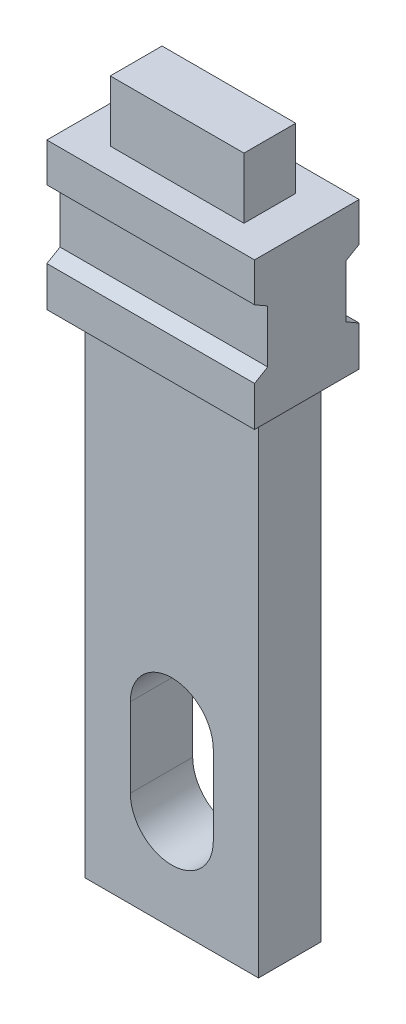
ISO-10303-21;
HEADER;
FILE_DESCRIPTION(('STEP AP214'),'2;1');
FILE_NAME('part.step','',(''),(''),'','','');
FILE_SCHEMA(('AUTOMOTIVE_DESIGN { 1 0 10303 214 1 1 1 1 }'));
ENDSEC;
DATA;
#1=APPLICATION_CONTEXT('core data for automotive mechanical design processes');
#2=APPLICATION_PROTOCOL_DEFINITION('international standard','automotive_design',2000,#1);
#3=PRODUCT_CONTEXT('',#1,'mechanical');
#4=PRODUCT('Part','Part','',(#3));
#5=PRODUCT_RELATED_PRODUCT_CATEGORY('part','',(#4));
#6=PRODUCT_DEFINITION_FORMATION('','',#4);
#7=PRODUCT_DEFINITION_CONTEXT('part definition',#1,'design');
#8=PRODUCT_DEFINITION('design','',#6,#7);
#9=PRODUCT_DEFINITION_SHAPE('','',#8);
#10=(LENGTH_UNIT() NAMED_UNIT(*) SI_UNIT(.MILLI.,.METRE.));
#11=(NAMED_UNIT(*) PLANE_ANGLE_UNIT() SI_UNIT($,.RADIAN.));
#12=(NAMED_UNIT(*) SI_UNIT($,.STERADIAN.) SOLID_ANGLE_UNIT());
#13=UNCERTAINTY_MEASURE_WITH_UNIT(LENGTH_MEASURE(1.E-05),#10,'distance_accuracy_value','');
#14=(GEOMETRIC_REPRESENTATION_CONTEXT(3) GLOBAL_UNCERTAINTY_ASSIGNED_CONTEXT((#13)) GLOBAL_UNIT_ASSIGNED_CONTEXT((#10,
#11,#12)) REPRESENTATION_CONTEXT('',''));
#15=CARTESIAN_POINT('',(0.,0.,0.));
#16=DIRECTION('',(0.,0.,1.));
#17=DIRECTION('',(1.,0.,0.));
#18=AXIS2_PLACEMENT_3D('',#15,#16,#17);
#19=CARTESIAN_POINT('',(-0.99822,0.5842,0.));
#20=DIRECTION('',(0.,1.,0.));
#21=DIRECTION('',(0.,0.,1.));
#22=AXIS2_PLACEMENT_3D('',#19,#20,#21);
#23=PLANE('',#22);
#24=DIRECTION('',(-1.,0.,0.));
#25=VECTOR('',#24,1.);
#26=CARTESIAN_POINT('',(0.64262,0.5842,-0.24892));
#27=LINE('',#26,#25);
#28=CARTESIAN_POINT('',(-0.64262,0.5842,-0.24892));
#29=VERTEX_POINT('',#28);
#30=CARTESIAN_POINT('',(0.64262,0.5842,-0.24892));
#31=VERTEX_POINT('',#30);
#32=EDGE_CURVE('E183',#29,#31,#27,.F.);
#33=ORIENTED_EDGE('',*,*,#32,.F.);
#34=DIRECTION('',(0.,0.,1.));
#35=VECTOR('',#34,1.);
#36=CARTESIAN_POINT('',(-0.64262,0.5842,-0.24892));
#37=LINE('',#36,#35);
#38=CARTESIAN_POINT('',(-0.64262,0.5842,0.24892));
#39=VERTEX_POINT('',#38);
#40=EDGE_CURVE('E342',#39,#29,#37,.F.);
#41=ORIENTED_EDGE('',*,*,#40,.F.);
#42=DIRECTION('',(1.,0.,0.));
#43=VECTOR('',#42,1.);
#44=CARTESIAN_POINT('',(-0.64262,0.5842,0.24892));
#45=LINE('',#44,#43);
#46=CARTESIAN_POINT('',(0.64262,0.5842,0.24892));
#47=VERTEX_POINT('',#46);
#48=EDGE_CURVE('E196',#47,#39,#45,.F.);
#49=ORIENTED_EDGE('',*,*,#48,.F.);
#50=DIRECTION('',(0.,0.,-1.));
#51=VECTOR('',#50,1.);
#52=CARTESIAN_POINT('',(0.64262,0.5842,0.24892));
#53=LINE('',#52,#51);
#54=EDGE_CURVE('E176',#31,#47,#53,.F.);
#55=ORIENTED_EDGE('',*,*,#54,.F.);
#56=EDGE_LOOP('',(#33,#41,#49,#55));
#57=FACE_BOUND('',#56,.T.);
#58=ADVANCED_FACE('F16',(#57),#23,.T.);
#59=CARTESIAN_POINT('',(0.64262,0.,-0.24892));
#60=DIRECTION('',(0.,0.,-1.));
#61=DIRECTION('',(-1.,0.,0.));
#62=AXIS2_PLACEMENT_3D('',#59,#60,#61);
#63=PLANE('',#62);
#64=DIRECTION('',(0.,1.,0.));
#65=VECTOR('',#64,1.);
#66=CARTESIAN_POINT('',(0.64262,0.,-0.24892));
#67=LINE('',#66,#65);
#68=CARTESIAN_POINT('',(0.64262,0.,-0.24892));
#69=VERTEX_POINT('',#68);
#70=EDGE_CURVE('E186',#69,#31,#67,.T.);
#71=ORIENTED_EDGE('',*,*,#70,.F.);
#72=DIRECTION('',(1.,0.,0.));
#73=VECTOR('',#72,1.);
#74=CARTESIAN_POINT('',(-0.99822,0.,-0.24892));
#75=LINE('',#74,#73);
#76=CARTESIAN_POINT('',(-0.64262,0.,-0.24892));
#77=VERTEX_POINT('',#76);
#78=EDGE_CURVE('E335',#77,#69,#75,.T.);
#79=ORIENTED_EDGE('',*,*,#78,.F.);
#80=DIRECTION('',(0.,1.,0.));
#81=VECTOR('',#80,1.);
#82=CARTESIAN_POINT('',(-0.64262,0.,-0.24892));
#83=LINE('',#82,#81);
#84=EDGE_CURVE('E188',#29,#77,#83,.F.);
#85=ORIENTED_EDGE('',*,*,#84,.F.);
#86=ORIENTED_EDGE('',*,*,#32,.T.);
#87=EDGE_LOOP('',(#71,#79,#85,#86));
#88=FACE_BOUND('',#87,.T.);
#89=ADVANCED_FACE('F184',(#88),#63,.T.);
#90=CARTESIAN_POINT('',(0.64262,0.,0.24892));
#91=DIRECTION('',(1.,0.,0.));
#92=DIRECTION('',(0.,0.,-1.));
#93=AXIS2_PLACEMENT_3D('',#90,#91,#92);
#94=PLANE('',#93);
#95=DIRECTION('',(0.,1.,0.));
#96=VECTOR('',#95,1.);
#97=CARTESIAN_POINT('',(0.64262,0.,0.24892));
#98=LINE('',#97,#96);
#99=CARTESIAN_POINT('',(0.64262,0.,0.24892));
#100=VERTEX_POINT('',#99);
#101=EDGE_CURVE('E197',#100,#47,#98,.T.);
#102=ORIENTED_EDGE('',*,*,#101,.F.);
#103=DIRECTION('',(0.,0.,1.));
#104=VECTOR('',#103,1.);
#105=CARTESIAN_POINT('',(0.64262,0.,-0.50292));
#106=LINE('',#105,#104);
#107=EDGE_CURVE('E193',#69,#100,#106,.T.);
#108=ORIENTED_EDGE('',*,*,#107,.F.);
#109=ORIENTED_EDGE('',*,*,#70,.T.);
#110=ORIENTED_EDGE('',*,*,#54,.T.);
#111=EDGE_LOOP('',(#102,#108,#109,#110));
#112=FACE_BOUND('',#111,.T.);
#113=ADVANCED_FACE('F192',(#112),#94,.T.);
#114=CARTESIAN_POINT('',(-0.64262,0.,0.24892));
#115=DIRECTION('',(0.,0.,1.));
#116=DIRECTION('',(1.,0.,0.));
#117=AXIS2_PLACEMENT_3D('',#114,#115,#116);
#118=PLANE('',#117);
#119=DIRECTION('',(0.,1.,0.));
#120=VECTOR('',#119,1.);
#121=CARTESIAN_POINT('',(-0.64262,0.,0.24892));
#122=LINE('',#121,#120);
#123=CARTESIAN_POINT('',(-0.64262,0.,0.24892));
#124=VERTEX_POINT('',#123);
#125=EDGE_CURVE('E344',#124,#39,#122,.T.);
#126=ORIENTED_EDGE('',*,*,#125,.F.);
#127=DIRECTION('',(1.,0.,0.));
#128=VECTOR('',#127,1.);
#129=CARTESIAN_POINT('',(-0.99822,0.,0.24892));
#130=LINE('',#129,#128);
#131=EDGE_CURVE('E332',#100,#124,#130,.F.);
#132=ORIENTED_EDGE('',*,*,#131,.F.);
#133=ORIENTED_EDGE('',*,*,#101,.T.);
#134=ORIENTED_EDGE('',*,*,#48,.T.);
#135=EDGE_LOOP('',(#126,#132,#133,#134));
#136=FACE_BOUND('',#135,.T.);
#137=ADVANCED_FACE('F348',(#136),#118,.T.);
#138=CARTESIAN_POINT('',(-0.64262,0.,-0.24892));
#139=DIRECTION('',(-1.,0.,0.));
#140=DIRECTION('',(0.,0.,1.));
#141=AXIS2_PLACEMENT_3D('',#138,#139,#140);
#142=PLANE('',#141);
#143=ORIENTED_EDGE('',*,*,#84,.T.);
#144=DIRECTION('',(0.,0.,1.));
#145=VECTOR('',#144,1.);
#146=CARTESIAN_POINT('',(-0.64262,0.,-0.50292));
#147=LINE('',#146,#145);
#148=EDGE_CURVE('E329',#124,#77,#147,.F.);
#149=ORIENTED_EDGE('',*,*,#148,.F.);
#150=ORIENTED_EDGE('',*,*,#125,.T.);
#151=ORIENTED_EDGE('',*,*,#40,.T.);
#152=EDGE_LOOP('',(#143,#149,#150,#151));
#153=FACE_BOUND('',#152,.T.);
#154=ADVANCED_FACE('F352',(#153),#142,.T.);
#155=CARTESIAN_POINT('',(-0.99822,0.,-0.50292));
#156=DIRECTION('',(0.,1.,0.));
#157=DIRECTION('',(0.,0.,1.));
#158=AXIS2_PLACEMENT_3D('',#155,#156,#157);
#159=PLANE('',#158);
#160=ORIENTED_EDGE('',*,*,#131,.T.);
#161=ORIENTED_EDGE('',*,*,#148,.T.);
#162=ORIENTED_EDGE('',*,*,#78,.T.);
#163=ORIENTED_EDGE('',*,*,#107,.T.);
#164=EDGE_LOOP('',(#160,#161,#162,#163));
#165=FACE_BOUND('',#164,.T.);
#166=DIRECTION('',(-1.,0.,0.));
#167=VECTOR('',#166,1.);
#168=CARTESIAN_POINT('',(-0.99822,0.,-0.50292));
#169=LINE('',#168,#167);
#170=CARTESIAN_POINT('',(-0.99822,0.,-0.50292));
#171=VERTEX_POINT('',#170);
#172=CARTESIAN_POINT('',(0.99822,0.,-0.50292));
#173=VERTEX_POINT('',#172);
#174=EDGE_CURVE('E326',#171,#173,#169,.F.);
#175=ORIENTED_EDGE('',*,*,#174,.F.);
#176=DIRECTION('',(0.,0.,1.));
#177=VECTOR('',#176,1.);
#178=CARTESIAN_POINT('',(-0.99822,0.,-0.50292));
#179=LINE('',#178,#177);
#180=CARTESIAN_POINT('',(-0.99822,0.,0.50292));
#181=VERTEX_POINT('',#180);
#182=EDGE_CURVE('E337',#171,#181,#179,.T.);
#183=ORIENTED_EDGE('',*,*,#182,.T.);
#184=DIRECTION('',(1.,0.,0.));
#185=VECTOR('',#184,1.);
#186=CARTESIAN_POINT('',(-0.99822,0.,0.50292));
#187=LINE('',#186,#185);
#188=CARTESIAN_POINT('',(0.99822,0.,0.50292));
#189=VERTEX_POINT('',#188);
#190=EDGE_CURVE('E316',#189,#181,#187,.F.);
#191=ORIENTED_EDGE('',*,*,#190,.F.);
#192=DIRECTION('',(0.,0.,1.));
#193=VECTOR('',#192,1.);
#194=CARTESIAN_POINT('',(0.99822,0.,-0.50292));
#195=LINE('',#194,#193);
#196=EDGE_CURVE('E339',#189,#173,#195,.F.);
#197=ORIENTED_EDGE('',*,*,#196,.T.);
#198=EDGE_LOOP('',(#175,#183,#191,#197));
#199=FACE_BOUND('',#198,.T.);
#200=ADVANCED_FACE('F354',(#165,#199),#159,.T.);
#201=CARTESIAN_POINT('',(-0.99822,-0.37371651581287,-0.50292));
#202=DIRECTION('',(0.,0.,-1.));
#203=DIRECTION('',(-1.,0.,0.));
#204=AXIS2_PLACEMENT_3D('',#201,#202,#203);
#205=PLANE('',#204);
#206=DIRECTION('',(1.,0.,0.));
#207=VECTOR('',#206,1.);
#208=CARTESIAN_POINT('',(-0.99822,-0.373716515812903,-0.502920000000019));
#209=LINE('',#208,#207);
#210=CARTESIAN_POINT('',(-0.99822,-0.373716515812878,-0.502920000000005));
#211=VERTEX_POINT('',#210);
#212=CARTESIAN_POINT('',(0.99822,-0.373716515812878,-0.502920000000005));
#213=VERTEX_POINT('',#212);
#214=EDGE_CURVE('E311',#211,#213,#209,.T.);
#215=ORIENTED_EDGE('',*,*,#214,.F.);
#216=DIRECTION('',(0.,1.,0.));
#217=VECTOR('',#216,1.);
#218=CARTESIAN_POINT('',(-0.99822,-0.37371651581287,-0.50292));
#219=LINE('',#218,#217);
#220=EDGE_CURVE('E321',#211,#171,#219,.T.);
#221=ORIENTED_EDGE('',*,*,#220,.T.);
#222=ORIENTED_EDGE('',*,*,#174,.T.);
#223=DIRECTION('',(0.,1.,0.));
#224=VECTOR('',#223,1.);
#225=CARTESIAN_POINT('',(0.99822,-0.37371651581287,-0.50292));
#226=LINE('',#225,#224);
#227=EDGE_CURVE('E324',#173,#213,#226,.F.);
#228=ORIENTED_EDGE('',*,*,#227,.T.);
#229=EDGE_LOOP('',(#215,#221,#222,#228));
#230=FACE_BOUND('',#229,.T.);
#231=ADVANCED_FACE('F357',(#230),#205,.T.);
#232=CARTESIAN_POINT('',(-0.99822,0.,0.50292));
#233=DIRECTION('',(0.,0.,1.));
#234=DIRECTION('',(1.,0.,0.));
#235=AXIS2_PLACEMENT_3D('',#232,#233,#234);
#236=PLANE('',#235);
#237=ORIENTED_EDGE('',*,*,#190,.T.);
#238=DIRECTION('',(0.,1.,0.));
#239=VECTOR('',#238,1.);
#240=CARTESIAN_POINT('',(-0.99822,0.,0.50292));
#241=LINE('',#240,#239);
#242=CARTESIAN_POINT('',(-0.99822,-0.37371651581287,0.50292));
#243=VERTEX_POINT('',#242);
#244=EDGE_CURVE('E314',#181,#243,#241,.F.);
#245=ORIENTED_EDGE('',*,*,#244,.T.);
#246=DIRECTION('',(1.,0.,0.));
#247=VECTOR('',#246,1.);
#248=CARTESIAN_POINT('',(-0.99822,-0.37371651581287,0.50292));
#249=LINE('',#248,#247);
#250=CARTESIAN_POINT('',(0.99822,-0.37371651581287,0.50292));
#251=VERTEX_POINT('',#250);
#252=EDGE_CURVE('E301',#251,#243,#249,.F.);
#253=ORIENTED_EDGE('',*,*,#252,.F.);
#254=DIRECTION('',(0.,1.,0.));
#255=VECTOR('',#254,1.);
#256=CARTESIAN_POINT('',(0.99822,0.,0.50292));
#257=LINE('',#256,#255);
#258=EDGE_CURVE('E319',#251,#189,#257,.T.);
#259=ORIENTED_EDGE('',*,*,#258,.T.);
#260=EDGE_LOOP('',(#237,#245,#253,#259));
#261=FACE_BOUND('',#260,.T.);
#262=ADVANCED_FACE('F412',(#261),#236,.T.);
#263=CARTESIAN_POINT('',(-0.99822,-0.44704,-0.37592));
#264=DIRECTION('',(0.,-0.866025403784429,-0.500000000000017));
#265=DIRECTION('',(0.,0.500000000000017,-0.866025403784429));
#266=AXIS2_PLACEMENT_3D('',#263,#264,#265);
#267=PLANE('',#266);
#268=DIRECTION('',(-1.,0.,0.));
#269=VECTOR('',#268,1.);
#270=CARTESIAN_POINT('',(-0.99822,-0.44704,-0.37592));
#271=LINE('',#270,#269);
#272=CARTESIAN_POINT('',(-0.99822,-0.44704,-0.37592));
#273=VERTEX_POINT('',#272);
#274=CARTESIAN_POINT('',(0.99822,-0.44704,-0.37592));
#275=VERTEX_POINT('',#274);
#276=EDGE_CURVE('E296',#273,#275,#271,.F.);
#277=ORIENTED_EDGE('',*,*,#276,.F.);
#278=DIRECTION('',(0.,0.500000000000017,-0.866025403784429));
#279=VECTOR('',#278,1.);
#280=CARTESIAN_POINT('',(-0.99822,-0.44704,-0.37592));
#281=LINE('',#280,#279);
#282=EDGE_CURVE('E306',#273,#211,#281,.T.);
#283=ORIENTED_EDGE('',*,*,#282,.T.);
#284=ORIENTED_EDGE('',*,*,#214,.T.);
#285=DIRECTION('',(0.,0.500000000000017,-0.866025403784429));
#286=VECTOR('',#285,1.);
#287=CARTESIAN_POINT('',(0.99822,-0.44704,-0.37592));
#288=LINE('',#287,#286);
#289=EDGE_CURVE('E309',#213,#275,#288,.F.);
#290=ORIENTED_EDGE('',*,*,#289,.T.);
#291=EDGE_LOOP('',(#277,#283,#284,#290));
#292=FACE_BOUND('',#291,.T.);
#293=ADVANCED_FACE('F373',(#292),#267,.T.);
#294=CARTESIAN_POINT('',(-0.99822,-0.37371651581287,0.50292));
#295=DIRECTION('',(0.,-0.866025403784429,0.500000000000017));
#296=DIRECTION('',(0.,-0.500000000000017,-0.866025403784429));
#297=AXIS2_PLACEMENT_3D('',#294,#295,#296);
#298=PLANE('',#297);
#299=ORIENTED_EDGE('',*,*,#252,.T.);
#300=DIRECTION('',(0.,-0.500000000000017,-0.866025403784429));
#301=VECTOR('',#300,1.);
#302=CARTESIAN_POINT('',(-0.99822,-0.37371651581287,0.50292));
#303=LINE('',#302,#301);
#304=CARTESIAN_POINT('',(-0.99822,-0.447039999999983,0.37591999999999));
#305=VERTEX_POINT('',#304);
#306=EDGE_CURVE('E299',#243,#305,#303,.T.);
#307=ORIENTED_EDGE('',*,*,#306,.T.);
#308=DIRECTION('',(1.,0.,0.));
#309=VECTOR('',#308,1.);
#310=CARTESIAN_POINT('',(-0.99822,-0.44704,0.37592));
#311=LINE('',#310,#309);
#312=CARTESIAN_POINT('',(0.99822,-0.447039999999992,0.375919999999995));
#313=VERTEX_POINT('',#312);
#314=EDGE_CURVE('E286',#313,#305,#311,.F.);
#315=ORIENTED_EDGE('',*,*,#314,.F.);
#316=DIRECTION('',(0.,-0.500000000000017,-0.866025403784429));
#317=VECTOR('',#316,1.);
#318=CARTESIAN_POINT('',(0.99822,-0.37371651581287,0.50292));
#319=LINE('',#318,#317);
#320=EDGE_CURVE('E304',#313,#251,#319,.F.);
#321=ORIENTED_EDGE('',*,*,#320,.T.);
#322=EDGE_LOOP('',(#299,#307,#315,#321));
#323=FACE_BOUND('',#322,.T.);
#324=ADVANCED_FACE('F408',(#323),#298,.T.);
#325=CARTESIAN_POINT('',(-0.99822,-0.95504,-0.37592));
#326=DIRECTION('',(0.,0.,-1.));
#327=DIRECTION('',(-1.,0.,0.));
#328=AXIS2_PLACEMENT_3D('',#325,#326,#327);
#329=PLANE('',#328);
#330=DIRECTION('',(1.,0.,0.));
#331=VECTOR('',#330,1.);
#332=CARTESIAN_POINT('',(-0.99822,-0.955040000000033,-0.375919999999981));
#333=LINE('',#332,#331);
#334=CARTESIAN_POINT('',(-0.99822,-0.955040000000008,-0.375919999999995));
#335=VERTEX_POINT('',#334);
#336=CARTESIAN_POINT('',(0.99822,-0.955040000000008,-0.375919999999995));
#337=VERTEX_POINT('',#336);
#338=EDGE_CURVE('E281',#335,#337,#333,.T.);
#339=ORIENTED_EDGE('',*,*,#338,.F.);
#340=DIRECTION('',(0.,1.,0.));
#341=VECTOR('',#340,1.);
#342=CARTESIAN_POINT('',(-0.99822,-0.95504,-0.37592));
#343=LINE('',#342,#341);
#344=EDGE_CURVE('E291',#335,#273,#343,.T.);
#345=ORIENTED_EDGE('',*,*,#344,.T.);
#346=ORIENTED_EDGE('',*,*,#276,.T.);
#347=DIRECTION('',(0.,1.,0.));
#348=VECTOR('',#347,1.);
#349=CARTESIAN_POINT('',(0.99822,-0.95504,-0.37592));
#350=LINE('',#349,#348);
#351=EDGE_CURVE('E294',#275,#337,#350,.F.);
#352=ORIENTED_EDGE('',*,*,#351,.T.);
#353=EDGE_LOOP('',(#339,#345,#346,#352));
#354=FACE_BOUND('',#353,.T.);
#355=ADVANCED_FACE('F376',(#354),#329,.T.);
#356=CARTESIAN_POINT('',(-0.99822,-0.44704,0.37592));
#357=DIRECTION('',(0.,0.,1.));
#358=DIRECTION('',(1.,0.,0.));
#359=AXIS2_PLACEMENT_3D('',#356,#357,#358);
#360=PLANE('',#359);
#361=ORIENTED_EDGE('',*,*,#314,.T.);
#362=DIRECTION('',(0.,1.,0.));
#363=VECTOR('',#362,1.);
#364=CARTESIAN_POINT('',(-0.99822,-0.44704,0.37592));
#365=LINE('',#364,#363);
#366=CARTESIAN_POINT('',(-0.99822,-0.95504,0.37592));
#367=VERTEX_POINT('',#366);
#368=EDGE_CURVE('E284',#305,#367,#365,.F.);
#369=ORIENTED_EDGE('',*,*,#368,.T.);
#370=DIRECTION('',(1.,0.,0.));
#371=VECTOR('',#370,1.);
#372=CARTESIAN_POINT('',(-0.99822,-0.95504,0.37592));
#373=LINE('',#372,#371);
#374=CARTESIAN_POINT('',(0.99822,-0.95504,0.37592));
#375=VERTEX_POINT('',#374);
#376=EDGE_CURVE('E273',#375,#367,#373,.F.);
#377=ORIENTED_EDGE('',*,*,#376,.F.);
#378=DIRECTION('',(0.,1.,0.));
#379=VECTOR('',#378,1.);
#380=CARTESIAN_POINT('',(0.99822,-0.44704,0.37592));
#381=LINE('',#380,#379);
#382=EDGE_CURVE('E289',#375,#313,#381,.T.);
#383=ORIENTED_EDGE('',*,*,#382,.T.);
#384=EDGE_LOOP('',(#361,#369,#377,#383));
#385=FACE_BOUND('',#384,.T.);
#386=ADVANCED_FACE('F404',(#385),#360,.T.);
#387=CARTESIAN_POINT('',(-0.99822,-1.02836348418713,-0.50292));
#388=DIRECTION('',(0.,0.866025403784429,-0.500000000000017));
#389=DIRECTION('',(0.,0.500000000000017,0.866025403784429));
#390=AXIS2_PLACEMENT_3D('',#387,#388,#389);
#391=PLANE('',#390);
#392=DIRECTION('',(-1.,0.,0.));
#393=VECTOR('',#392,1.);
#394=CARTESIAN_POINT('',(-0.99822,-1.02836348418713,-0.50292));
#395=LINE('',#394,#393);
#396=CARTESIAN_POINT('',(-0.99822,-1.02836348418713,-0.50292));
#397=VERTEX_POINT('',#396);
#398=CARTESIAN_POINT('',(0.99822,-1.02836348418713,-0.50292));
#399=VERTEX_POINT('',#398);
#400=EDGE_CURVE('E268',#397,#399,#395,.F.);
#401=ORIENTED_EDGE('',*,*,#400,.F.);
#402=DIRECTION('',(0.,0.500000000000017,0.866025403784429));
#403=VECTOR('',#402,1.);
#404=CARTESIAN_POINT('',(-0.99822,-1.02836348418713,-0.50292));
#405=LINE('',#404,#403);
#406=EDGE_CURVE('E276',#397,#335,#405,.T.);
#407=ORIENTED_EDGE('',*,*,#406,.T.);
#408=ORIENTED_EDGE('',*,*,#338,.T.);
#409=DIRECTION('',(0.,0.500000000000017,0.866025403784429));
#410=VECTOR('',#409,1.);
#411=CARTESIAN_POINT('',(0.99822,-1.02836348418713,-0.50292));
#412=LINE('',#411,#410);
#413=EDGE_CURVE('E279',#337,#399,#412,.F.);
#414=ORIENTED_EDGE('',*,*,#413,.T.);
#415=EDGE_LOOP('',(#401,#407,#408,#414));
#416=FACE_BOUND('',#415,.T.);
#417=ADVANCED_FACE('F381',(#416),#391,.T.);
#418=CARTESIAN_POINT('',(-0.99822,-0.95504,0.37592));
#419=DIRECTION('',(0.,0.866025403784429,0.500000000000017));
#420=DIRECTION('',(0.,-0.500000000000017,0.866025403784429));
#421=AXIS2_PLACEMENT_3D('',#418,#419,#420);
#422=PLANE('',#421);
#423=ORIENTED_EDGE('',*,*,#376,.T.);
#424=DIRECTION('',(0.,-0.500000000000017,0.866025403784429));
#425=VECTOR('',#424,1.);
#426=CARTESIAN_POINT('',(-0.99822,-0.95504,0.37592));
#427=LINE('',#426,#425);
#428=CARTESIAN_POINT('',(-0.99822,-1.02836348418711,0.50292000000001));
#429=VERTEX_POINT('',#428);
#430=EDGE_CURVE('E271',#367,#429,#427,.T.);
#431=ORIENTED_EDGE('',*,*,#430,.T.);
#432=DIRECTION('',(1.,0.,0.));
#433=VECTOR('',#432,1.);
#434=CARTESIAN_POINT('',(-0.99822,-1.02836348418713,0.50292));
#435=LINE('',#434,#433);
#436=CARTESIAN_POINT('',(0.99822,-1.02836348418712,0.502920000000005));
#437=VERTEX_POINT('',#436);
#438=EDGE_CURVE('E257',#437,#429,#435,.F.);
#439=ORIENTED_EDGE('',*,*,#438,.F.);
#440=DIRECTION('',(0.,-0.500000000000242,0.866025403784299));
#441=VECTOR('',#440,1.);
#442=CARTESIAN_POINT('',(0.99822,-0.95504,0.37592));
#443=LINE('',#442,#441);
#444=EDGE_CURVE('E266',#375,#437,#443,.T.);
#445=ORIENTED_EDGE('',*,*,#444,.F.);
#446=EDGE_LOOP('',(#423,#431,#439,#445));
#447=FACE_BOUND('',#446,.T.);
#448=ADVANCED_FACE('F400',(#447),#422,.T.);
#449=CARTESIAN_POINT('',(-0.99822,-1.41224,-0.50292));
#450=DIRECTION('',(0.,0.,-1.));
#451=DIRECTION('',(-1.,0.,0.));
#452=AXIS2_PLACEMENT_3D('',#449,#450,#451);
#453=PLANE('',#452);
#454=DIRECTION('',(1.,0.,0.));
#455=VECTOR('',#454,1.);
#456=CARTESIAN_POINT('',(-0.99822,-1.41224,-0.50292));
#457=LINE('',#456,#455);
#458=CARTESIAN_POINT('',(-0.99822,-1.41224,-0.50292));
#459=VERTEX_POINT('',#458);
#460=CARTESIAN_POINT('',(0.99822,-1.41224,-0.50292));
#461=VERTEX_POINT('',#460);
#462=EDGE_CURVE('E248',#459,#461,#457,.T.);
#463=ORIENTED_EDGE('',*,*,#462,.F.);
#464=DIRECTION('',(0.,1.,0.));
#465=VECTOR('',#464,1.);
#466=CARTESIAN_POINT('',(-0.99822,0.,-0.50292));
#467=LINE('',#466,#465);
#468=EDGE_CURVE('E250',#459,#397,#467,.T.);
#469=ORIENTED_EDGE('',*,*,#468,.T.);
#470=ORIENTED_EDGE('',*,*,#400,.T.);
#471=DIRECTION('',(0.,1.,0.));
#472=VECTOR('',#471,1.);
#473=CARTESIAN_POINT('',(0.99822,0.,-0.50292));
#474=LINE('',#473,#472);
#475=EDGE_CURVE('E263',#461,#399,#474,.T.);
#476=ORIENTED_EDGE('',*,*,#475,.F.);
#477=EDGE_LOOP('',(#463,#469,#470,#476));
#478=FACE_BOUND('',#477,.T.);
#479=ADVANCED_FACE('F385',(#478),#453,.T.);
#480=CARTESIAN_POINT('',(0.99822,0.,0.));
#481=DIRECTION('',(1.,0.,0.));
#482=DIRECTION('',(0.,0.,-1.));
#483=AXIS2_PLACEMENT_3D('',#480,#481,#482);
#484=PLANE('',#483);
#485=ORIENTED_EDGE('',*,*,#227,.F.);
#486=ORIENTED_EDGE('',*,*,#196,.F.);
#487=ORIENTED_EDGE('',*,*,#258,.F.);
#488=ORIENTED_EDGE('',*,*,#320,.F.);
#489=ORIENTED_EDGE('',*,*,#382,.F.);
#490=ORIENTED_EDGE('',*,*,#444,.T.);
#491=DIRECTION('',(0.,1.,0.));
#492=VECTOR('',#491,1.);
#493=CARTESIAN_POINT('',(0.99822,-1.02836348418713,0.50292));
#494=LINE('',#493,#492);
#495=CARTESIAN_POINT('',(0.99822,-1.41224,0.50292));
#496=VERTEX_POINT('',#495);
#497=EDGE_CURVE('E260',#496,#437,#494,.T.);
#498=ORIENTED_EDGE('',*,*,#497,.F.);
#499=DIRECTION('',(0.,0.,-1.));
#500=VECTOR('',#499,1.);
#501=CARTESIAN_POINT('',(0.99822,-1.41224,0.50292));
#502=LINE('',#501,#500);
#503=EDGE_CURVE('E246',#461,#496,#502,.F.);
#504=ORIENTED_EDGE('',*,*,#503,.F.);
#505=ORIENTED_EDGE('',*,*,#475,.T.);
#506=ORIENTED_EDGE('',*,*,#413,.F.);
#507=ORIENTED_EDGE('',*,*,#351,.F.);
#508=ORIENTED_EDGE('',*,*,#289,.F.);
#509=EDGE_LOOP('',(#485,#486,#487,#488,#489,#490,#498,#504,#505,#506,#507,#508));
#510=FACE_BOUND('',#509,.T.);
#511=ADVANCED_FACE('F367',(#510),#484,.T.);
#512=CARTESIAN_POINT('',(-0.99822,-1.02836348418713,0.50292));
#513=DIRECTION('',(0.,0.,1.));
#514=DIRECTION('',(1.,0.,0.));
#515=AXIS2_PLACEMENT_3D('',#512,#513,#514);
#516=PLANE('',#515);
#517=ORIENTED_EDGE('',*,*,#438,.T.);
#518=DIRECTION('',(0.,1.,0.));
#519=VECTOR('',#518,1.);
#520=CARTESIAN_POINT('',(-0.99822,0.,0.50292));
#521=LINE('',#520,#519);
#522=CARTESIAN_POINT('',(-0.99822,-1.41224,0.50292));
#523=VERTEX_POINT('',#522);
#524=EDGE_CURVE('E254',#429,#523,#521,.F.);
#525=ORIENTED_EDGE('',*,*,#524,.T.);
#526=DIRECTION('',(1.,0.,0.));
#527=VECTOR('',#526,1.);
#528=CARTESIAN_POINT('',(-0.99822,-1.41224,0.50292));
#529=LINE('',#528,#527);
#530=EDGE_CURVE('E244',#496,#523,#529,.F.);
#531=ORIENTED_EDGE('',*,*,#530,.F.);
#532=ORIENTED_EDGE('',*,*,#497,.T.);
#533=EDGE_LOOP('',(#517,#525,#531,#532));
#534=FACE_BOUND('',#533,.T.);
#535=ADVANCED_FACE('F394',(#534),#516,.T.);
#536=CARTESIAN_POINT('',(-0.99822,0.,0.));
#537=DIRECTION('',(1.,0.,0.));
#538=DIRECTION('',(0.,0.,-1.));
#539=AXIS2_PLACEMENT_3D('',#536,#537,#538);
#540=PLANE('',#539);
#541=ORIENTED_EDGE('',*,*,#282,.F.);
#542=ORIENTED_EDGE('',*,*,#344,.F.);
#543=ORIENTED_EDGE('',*,*,#406,.F.);
#544=ORIENTED_EDGE('',*,*,#468,.F.);
#545=DIRECTION('',(0.,0.,-1.));
#546=VECTOR('',#545,1.);
#547=CARTESIAN_POINT('',(-0.99822,-1.41224,0.50292));
#548=LINE('',#547,#546);
#549=EDGE_CURVE('E241',#523,#459,#548,.T.);
#550=ORIENTED_EDGE('',*,*,#549,.F.);
#551=ORIENTED_EDGE('',*,*,#524,.F.);
#552=ORIENTED_EDGE('',*,*,#430,.F.);
#553=ORIENTED_EDGE('',*,*,#368,.F.);
#554=ORIENTED_EDGE('',*,*,#306,.F.);
#555=ORIENTED_EDGE('',*,*,#244,.F.);
#556=ORIENTED_EDGE('',*,*,#182,.F.);
#557=ORIENTED_EDGE('',*,*,#220,.F.);
#558=EDGE_LOOP('',(#541,#542,#543,#544,#550,#551,#552,#553,#554,#555,#556,#557));
#559=FACE_BOUND('',#558,.T.);
#560=ADVANCED_FACE('F378',(#559),#540,.F.);
#561=CARTESIAN_POINT('',(0.,0.,0.29972));
#562=DIRECTION('',(0.,0.,1.));
#563=DIRECTION('',(1.,0.,0.));
#564=AXIS2_PLACEMENT_3D('',#561,#562,#563);
#565=PLANE('',#564);
#566=CARTESIAN_POINT('',(0.,-5.24002,0.29972));
#567=DIRECTION('',(0.,0.,1.));
#568=DIRECTION('',(1.,0.,0.));
#569=AXIS2_PLACEMENT_3D('',#566,#567,#568);
#570=CIRCLE('',#569,0.39878);
#571=CARTESIAN_POINT('',(0.39878,-5.24002,0.29972));
#572=VERTEX_POINT('',#571);
#573=CARTESIAN_POINT('',(-0.39878,-5.24002,0.29972));
#574=VERTEX_POINT('',#573);
#575=EDGE_CURVE('E205',#572,#574,#570,.F.);
#576=ORIENTED_EDGE('',*,*,#575,.T.);
#577=DIRECTION('',(0.,1.,0.));
#578=VECTOR('',#577,1.);
#579=CARTESIAN_POINT('',(-0.39878,-4.47802,0.29972));
#580=LINE('',#579,#578);
#581=CARTESIAN_POINT('',(-0.39878,-4.47802,0.29972));
#582=VERTEX_POINT('',#581);
#583=EDGE_CURVE('E60',#574,#582,#580,.T.);
#584=ORIENTED_EDGE('',*,*,#583,.T.);
#585=CARTESIAN_POINT('',(0.,-4.47802,0.29972));
#586=DIRECTION('',(0.,0.,1.));
#587=DIRECTION('',(1.,0.,0.));
#588=AXIS2_PLACEMENT_3D('',#585,#586,#587);
#589=CIRCLE('',#588,0.39878);
#590=CARTESIAN_POINT('',(0.39878,-4.47802,0.29972));
#591=VERTEX_POINT('',#590);
#592=EDGE_CURVE('E19',#582,#591,#589,.F.);
#593=ORIENTED_EDGE('',*,*,#592,.T.);
#594=DIRECTION('',(0.,1.,0.));
#595=VECTOR('',#594,1.);
#596=CARTESIAN_POINT('',(0.39878,-5.24002,0.29972));
#597=LINE('',#596,#595);
#598=EDGE_CURVE('E210',#591,#572,#597,.F.);
#599=ORIENTED_EDGE('',*,*,#598,.T.);
#600=EDGE_LOOP('',(#576,#584,#593,#599));
#601=FACE_BOUND('',#600,.T.);
#602=DIRECTION('',(0.,1.,0.));
#603=VECTOR('',#602,1.);
#604=CARTESIAN_POINT('',(0.83312,-6.16204,0.29972));
#605=LINE('',#604,#603);
#606=CARTESIAN_POINT('',(0.83312,-1.41224,0.29972));
#607=VERTEX_POINT('',#606);
#608=CARTESIAN_POINT('',(0.83312,-6.16204,0.29972));
#609=VERTEX_POINT('',#608);
#610=EDGE_CURVE('E69',#607,#609,#605,.F.);
#611=ORIENTED_EDGE('',*,*,#610,.F.);
#612=DIRECTION('',(1.,0.,0.));
#613=VECTOR('',#612,1.);
#614=CARTESIAN_POINT('',(-0.99822,-1.41224,0.29972));
#615=LINE('',#614,#613);
#616=CARTESIAN_POINT('',(-0.83312,-1.41224,0.29972));
#617=VERTEX_POINT('',#616);
#618=EDGE_CURVE('E239',#617,#607,#615,.T.);
#619=ORIENTED_EDGE('',*,*,#618,.F.);
#620=DIRECTION('',(0.,1.,0.));
#621=VECTOR('',#620,1.);
#622=CARTESIAN_POINT('',(-0.83312,-1.41224,0.29972));
#623=LINE('',#622,#621);
#624=CARTESIAN_POINT('',(-0.83312,-6.16204,0.29972));
#625=VERTEX_POINT('',#624);
#626=EDGE_CURVE('E237',#625,#617,#623,.T.);
#627=ORIENTED_EDGE('',*,*,#626,.F.);
#628=DIRECTION('',(1.,0.,0.));
#629=VECTOR('',#628,1.);
#630=CARTESIAN_POINT('',(-0.83312,-6.16204,0.29972));
#631=LINE('',#630,#629);
#632=EDGE_CURVE('E232',#609,#625,#631,.F.);
#633=ORIENTED_EDGE('',*,*,#632,.F.);
#634=EDGE_LOOP('',(#611,#619,#627,#633));
#635=FACE_BOUND('',#634,.T.);
#636=ADVANCED_FACE('F458',(#601,#635),#565,.T.);
#637=CARTESIAN_POINT('',(-0.99822,-1.41224,0.50292));
#638=DIRECTION('',(0.,-1.,0.));
#639=DIRECTION('',(0.,0.,-1.));
#640=AXIS2_PLACEMENT_3D('',#637,#638,#639);
#641=PLANE('',#640);
#642=DIRECTION('',(0.,0.,-1.));
#643=VECTOR('',#642,1.);
#644=CARTESIAN_POINT('',(0.83312,-1.41224,-0.29972));
#645=LINE('',#644,#643);
#646=CARTESIAN_POINT('',(0.83312,-1.41224,-0.29972));
#647=VERTEX_POINT('',#646);
#648=EDGE_CURVE('E224',#647,#607,#645,.F.);
#649=ORIENTED_EDGE('',*,*,#648,.F.);
#650=DIRECTION('',(1.,0.,0.));
#651=VECTOR('',#650,1.);
#652=CARTESIAN_POINT('',(0.,-1.41224,-0.29972));
#653=LINE('',#652,#651);
#654=CARTESIAN_POINT('',(-0.83312,-1.41224,-0.29972));
#655=VERTEX_POINT('',#654);
#656=EDGE_CURVE('E208',#647,#655,#653,.F.);
#657=ORIENTED_EDGE('',*,*,#656,.T.);
#658=DIRECTION('',(0.,0.,1.));
#659=VECTOR('',#658,1.);
#660=CARTESIAN_POINT('',(-0.83312,-1.41224,-0.29972));
#661=LINE('',#660,#659);
#662=EDGE_CURVE('E234',#617,#655,#661,.F.);
#663=ORIENTED_EDGE('',*,*,#662,.F.);
#664=ORIENTED_EDGE('',*,*,#618,.T.);
#665=EDGE_LOOP('',(#649,#657,#663,#664));
#666=FACE_BOUND('',#665,.T.);
#667=ORIENTED_EDGE('',*,*,#530,.T.);
#668=ORIENTED_EDGE('',*,*,#549,.T.);
#669=ORIENTED_EDGE('',*,*,#462,.T.);
#670=ORIENTED_EDGE('',*,*,#503,.T.);
#671=EDGE_LOOP('',(#667,#668,#669,#670));
#672=FACE_BOUND('',#671,.T.);
#673=ADVANCED_FACE('F389',(#666,#672),#641,.T.);
#674=CARTESIAN_POINT('',(-0.83312,-1.41224,-0.29972));
#675=DIRECTION('',(-1.,0.,0.));
#676=DIRECTION('',(0.,0.,1.));
#677=AXIS2_PLACEMENT_3D('',#674,#675,#676);
#678=PLANE('',#677);
#679=ORIENTED_EDGE('',*,*,#626,.T.);
#680=ORIENTED_EDGE('',*,*,#662,.T.);
#681=DIRECTION('',(0.,1.,0.));
#682=VECTOR('',#681,1.);
#683=CARTESIAN_POINT('',(-0.83312,0.,-0.29972));
#684=LINE('',#683,#682);
#685=CARTESIAN_POINT('',(-0.83312,-6.16204,-0.29972));
#686=VERTEX_POINT('',#685);
#687=EDGE_CURVE('E680',#655,#686,#684,.F.);
#688=ORIENTED_EDGE('',*,*,#687,.T.);
#689=DIRECTION('',(0.,0.,-1.));
#690=VECTOR('',#689,1.);
#691=CARTESIAN_POINT('',(-0.83312,-6.16204,-0.29972));
#692=LINE('',#691,#690);
#693=EDGE_CURVE('E229',#625,#686,#692,.T.);
#694=ORIENTED_EDGE('',*,*,#693,.F.);
#695=EDGE_LOOP('',(#679,#680,#688,#694));
#696=FACE_BOUND('',#695,.T.);
#697=ADVANCED_FACE('F451',(#696),#678,.T.);
#698=CARTESIAN_POINT('',(-0.83312,-6.16204,-0.29972));
#699=DIRECTION('',(0.,-1.,0.));
#700=DIRECTION('',(0.,0.,-1.));
#701=AXIS2_PLACEMENT_3D('',#698,#699,#700);
#702=PLANE('',#701);
#703=ORIENTED_EDGE('',*,*,#693,.T.);
#704=DIRECTION('',(1.,0.,0.));
#705=VECTOR('',#704,1.);
#706=CARTESIAN_POINT('',(0.,-6.16204,-0.29972));
#707=LINE('',#706,#705);
#708=CARTESIAN_POINT('',(0.83312,-6.16204,-0.29972));
#709=VERTEX_POINT('',#708);
#710=EDGE_CURVE('E666',#686,#709,#707,.T.);
#711=ORIENTED_EDGE('',*,*,#710,.T.);
#712=DIRECTION('',(0.,0.,-1.));
#713=VECTOR('',#712,1.);
#714=CARTESIAN_POINT('',(0.83312,-6.16204,-0.29972));
#715=LINE('',#714,#713);
#716=EDGE_CURVE('E226',#609,#709,#715,.T.);
#717=ORIENTED_EDGE('',*,*,#716,.F.);
#718=ORIENTED_EDGE('',*,*,#632,.T.);
#719=EDGE_LOOP('',(#703,#711,#717,#718));
#720=FACE_BOUND('',#719,.T.);
#721=ADVANCED_FACE('F448',(#720),#702,.T.);
#722=CARTESIAN_POINT('',(0.83312,-6.16204,-0.29972));
#723=DIRECTION('',(1.,0.,0.));
#724=DIRECTION('',(0.,0.,-1.));
#725=AXIS2_PLACEMENT_3D('',#722,#723,#724);
#726=PLANE('',#725);
#727=DIRECTION('',(0.,1.,0.));
#728=VECTOR('',#727,1.);
#729=CARTESIAN_POINT('',(0.83312,0.,-0.29972));
#730=LINE('',#729,#728);
#731=EDGE_CURVE('E669',#709,#647,#730,.T.);
#732=ORIENTED_EDGE('',*,*,#731,.T.);
#733=ORIENTED_EDGE('',*,*,#648,.T.);
#734=ORIENTED_EDGE('',*,*,#610,.T.);
#735=ORIENTED_EDGE('',*,*,#716,.T.);
#736=EDGE_LOOP('',(#732,#733,#734,#735));
#737=FACE_BOUND('',#736,.T.);
#738=ADVANCED_FACE('F444',(#737),#726,.T.);
#739=CARTESIAN_POINT('',(-0.39878,-4.47802,0.603504));
#740=DIRECTION('',(-1.,0.,0.));
#741=DIRECTION('',(0.,0.,1.));
#742=AXIS2_PLACEMENT_3D('',#739,#740,#741);
#743=PLANE('',#742);
#744=ORIENTED_EDGE('',*,*,#583,.F.);
#745=DIRECTION('',(0.,0.,1.));
#746=VECTOR('',#745,1.);
#747=CARTESIAN_POINT('',(-0.39878,-5.24002,0.603504));
#748=LINE('',#747,#746);
#749=CARTESIAN_POINT('',(-0.39878,-5.24002,-0.29972));
#750=VERTEX_POINT('',#749);
#751=EDGE_CURVE('E206',#574,#750,#748,.F.);
#752=ORIENTED_EDGE('',*,*,#751,.T.);
#753=DIRECTION('',(0.,1.,0.));
#754=VECTOR('',#753,1.);
#755=CARTESIAN_POINT('',(-0.39878,0.,-0.29972));
#756=LINE('',#755,#754);
#757=CARTESIAN_POINT('',(-0.39878,-4.47802,-0.29972));
#758=VERTEX_POINT('',#757);
#759=EDGE_CURVE('E204',#750,#758,#756,.T.);
#760=ORIENTED_EDGE('',*,*,#759,.T.);
#761=DIRECTION('',(0.,0.,1.));
#762=VECTOR('',#761,1.);
#763=CARTESIAN_POINT('',(-0.39878,-4.47802,0.603504));
#764=LINE('',#763,#762);
#765=EDGE_CURVE('E221',#758,#582,#764,.T.);
#766=ORIENTED_EDGE('',*,*,#765,.T.);
#767=EDGE_LOOP('',(#744,#752,#760,#766));
#768=FACE_BOUND('',#767,.T.);
#769=ADVANCED_FACE('F440',(#768),#743,.F.);
#770=CARTESIAN_POINT('',(0.,-4.47802,0.603504));
#771=DIRECTION('',(0.,0.,1.));
#772=DIRECTION('',(1.,0.,0.));
#773=AXIS2_PLACEMENT_3D('',#770,#771,#772);
#774=CYLINDRICAL_SURFACE('',#773,0.39878);
#775=ORIENTED_EDGE('',*,*,#592,.F.);
#776=ORIENTED_EDGE('',*,*,#765,.F.);
#777=CARTESIAN_POINT('',(0.,-4.47802,-0.29972));
#778=DIRECTION('',(0.,0.,1.));
#779=DIRECTION('',(1.,0.,0.));
#780=AXIS2_PLACEMENT_3D('',#777,#778,#779);
#781=CIRCLE('',#780,0.39878);
#782=CARTESIAN_POINT('',(0.39878,-4.47802,-0.29972));
#783=VERTEX_POINT('',#782);
#784=EDGE_CURVE('E202',#758,#783,#781,.F.);
#785=ORIENTED_EDGE('',*,*,#784,.T.);
#786=DIRECTION('',(0.,0.,-1.));
#787=VECTOR('',#786,1.);
#788=CARTESIAN_POINT('',(0.39878,-4.47802,0.603504));
#789=LINE('',#788,#787);
#790=EDGE_CURVE('E215',#783,#591,#789,.F.);
#791=ORIENTED_EDGE('',*,*,#790,.T.);
#792=EDGE_LOOP('',(#775,#776,#785,#791));
#793=FACE_BOUND('',#792,.T.);
#794=ADVANCED_FACE('F437',(#793),#774,.F.);
#795=CARTESIAN_POINT('',(0.39878,-5.24002,0.603504));
#796=DIRECTION('',(1.,0.,0.));
#797=DIRECTION('',(0.,0.,-1.));
#798=AXIS2_PLACEMENT_3D('',#795,#796,#797);
#799=PLANE('',#798);
#800=ORIENTED_EDGE('',*,*,#598,.F.);
#801=ORIENTED_EDGE('',*,*,#790,.F.);
#802=DIRECTION('',(0.,1.,0.));
#803=VECTOR('',#802,1.);
#804=CARTESIAN_POINT('',(0.39878,0.,-0.29972));
#805=LINE('',#804,#803);
#806=CARTESIAN_POINT('',(0.39878,-5.24002,-0.29972));
#807=VERTEX_POINT('',#806);
#808=EDGE_CURVE('E25',#783,#807,#805,.F.);
#809=ORIENTED_EDGE('',*,*,#808,.T.);
#810=DIRECTION('',(0.,0.,1.));
#811=VECTOR('',#810,1.);
#812=CARTESIAN_POINT('',(0.39878,-5.24002,0.603504));
#813=LINE('',#812,#811);
#814=EDGE_CURVE('E33',#807,#572,#813,.T.);
#815=ORIENTED_EDGE('',*,*,#814,.T.);
#816=EDGE_LOOP('',(#800,#801,#809,#815));
#817=FACE_BOUND('',#816,.T.);
#818=ADVANCED_FACE('F430',(#817),#799,.F.);
#819=CARTESIAN_POINT('',(0.,-5.24002,0.603504));
#820=DIRECTION('',(0.,0.,1.));
#821=DIRECTION('',(1.,0.,0.));
#822=AXIS2_PLACEMENT_3D('',#819,#820,#821);
#823=CYLINDRICAL_SURFACE('',#822,0.39878);
#824=ORIENTED_EDGE('',*,*,#575,.F.);
#825=ORIENTED_EDGE('',*,*,#814,.F.);
#826=CARTESIAN_POINT('',(0.,-5.24002,-0.29972));
#827=DIRECTION('',(0.,0.,1.));
#828=DIRECTION('',(1.,0.,0.));
#829=AXIS2_PLACEMENT_3D('',#826,#827,#828);
#830=CIRCLE('',#829,0.39878);
#831=EDGE_CURVE('E11',#807,#750,#830,.F.);
#832=ORIENTED_EDGE('',*,*,#831,.T.);
#833=ORIENTED_EDGE('',*,*,#751,.F.);
#834=EDGE_LOOP('',(#824,#825,#832,#833));
#835=FACE_BOUND('',#834,.T.);
#836=ADVANCED_FACE('F424',(#835),#823,.F.);
#837=CARTESIAN_POINT('',(0.,0.,-0.29972));
#838=DIRECTION('',(0.,0.,1.));
#839=DIRECTION('',(1.,0.,0.));
#840=AXIS2_PLACEMENT_3D('',#837,#838,#839);
#841=PLANE('',#840);
#842=ORIENTED_EDGE('',*,*,#808,.F.);
#843=ORIENTED_EDGE('',*,*,#784,.F.);
#844=ORIENTED_EDGE('',*,*,#759,.F.);
#845=ORIENTED_EDGE('',*,*,#831,.F.);
#846=EDGE_LOOP('',(#842,#843,#844,#845));
#847=FACE_BOUND('',#846,.T.);
#848=ORIENTED_EDGE('',*,*,#710,.F.);
#849=ORIENTED_EDGE('',*,*,#687,.F.);
#850=ORIENTED_EDGE('',*,*,#656,.F.);
#851=ORIENTED_EDGE('',*,*,#731,.F.);
#852=EDGE_LOOP('',(#848,#849,#850,#851));
#853=FACE_BOUND('',#852,.T.);
#854=ADVANCED_FACE('F422',(#847,#853),#841,.F.);
#855=CLOSED_SHELL('',(#58,#89,#113,#137,#154,#200,#231,#262,#293,#324,#355,#386,#417,#448,#479,
#511,#535,#560,#636,#673,#697,#721,#738,#769,#794,#818,#836,#854));
#856=MANIFOLD_SOLID_BREP('B1',#855);
#857=ADVANCED_BREP_SHAPE_REPRESENTATION('',(#18,#856),#14);
#858=SHAPE_DEFINITION_REPRESENTATION(#9,#857);
ENDSEC;
END-ISO-10303-21;
